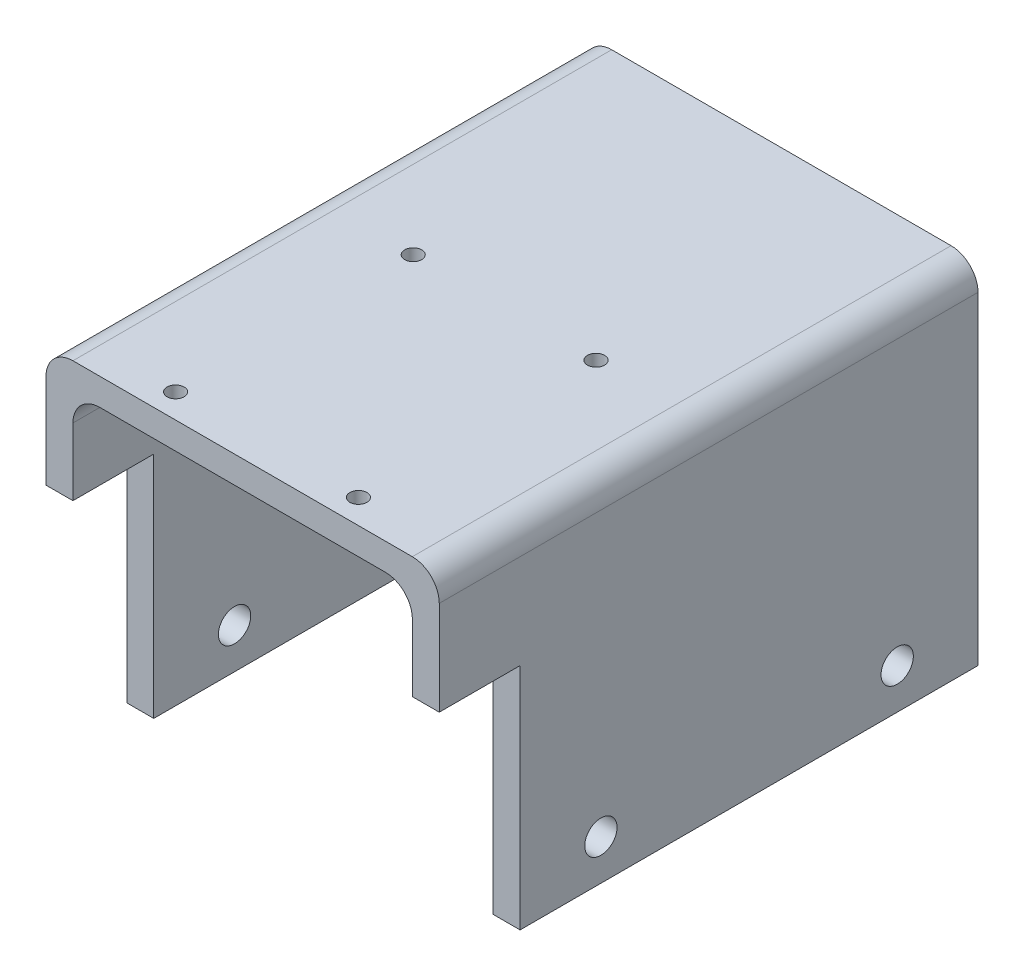
ISO-10303-21;
HEADER;
FILE_DESCRIPTION(('STEP AP214'),'2;1');
FILE_NAME('part.step','',(''),(''),'','','');
FILE_SCHEMA(('AUTOMOTIVE_DESIGN { 1 0 10303 214 1 1 1 1 }'));
ENDSEC;
DATA;
#1=APPLICATION_CONTEXT('core data for automotive mechanical design processes');
#2=APPLICATION_PROTOCOL_DEFINITION('international standard','automotive_design',2000,#1);
#3=PRODUCT_CONTEXT('',#1,'mechanical');
#4=PRODUCT('Part','Part','',(#3));
#5=PRODUCT_RELATED_PRODUCT_CATEGORY('part','',(#4));
#6=PRODUCT_DEFINITION_FORMATION('','',#4);
#7=PRODUCT_DEFINITION_CONTEXT('part definition',#1,'design');
#8=PRODUCT_DEFINITION('design','',#6,#7);
#9=PRODUCT_DEFINITION_SHAPE('','',#8);
#10=(LENGTH_UNIT() NAMED_UNIT(*) SI_UNIT(.MILLI.,.METRE.));
#11=(NAMED_UNIT(*) PLANE_ANGLE_UNIT() SI_UNIT($,.RADIAN.));
#12=(NAMED_UNIT(*) SI_UNIT($,.STERADIAN.) SOLID_ANGLE_UNIT());
#13=UNCERTAINTY_MEASURE_WITH_UNIT(LENGTH_MEASURE(1.E-05),#10,'distance_accuracy_value','');
#14=(GEOMETRIC_REPRESENTATION_CONTEXT(3) GLOBAL_UNCERTAINTY_ASSIGNED_CONTEXT((#13)) GLOBAL_UNIT_ASSIGNED_CONTEXT((#10,
#11,#12)) REPRESENTATION_CONTEXT('',''));
#15=CARTESIAN_POINT('',(0.,0.,0.));
#16=DIRECTION('',(0.,0.,1.));
#17=DIRECTION('',(1.,0.,0.));
#18=AXIS2_PLACEMENT_3D('',#15,#16,#17);
#19=CARTESIAN_POINT('',(-136.,130.,200.));
#20=DIRECTION('',(1.,0.,0.));
#21=DIRECTION('',(0.,1.,0.));
#22=AXIS2_PLACEMENT_3D('',#19,#20,#21);
#23=PLANE('',#22);
#24=CARTESIAN_POINT('',(-136.,15.,140.));
#25=DIRECTION('',(1.,0.,0.));
#26=DIRECTION('',(0.,0.,-1.));
#27=AXIS2_PLACEMENT_3D('',#24,#25,#26);
#28=CIRCLE('',#27,6.00000000000002);
#29=CARTESIAN_POINT('',(-136.,15.,134.));
#30=VERTEX_POINT('',#29);
#31=EDGE_CURVE('E491',#30,#30,#28,.T.);
#32=ORIENTED_EDGE('',*,*,#31,.T.);
#33=EDGE_LOOP('',(#32));
#34=FACE_BOUND('',#33,.T.);
#35=CARTESIAN_POINT('',(-136.,15.,30.));
#36=DIRECTION('',(1.,0.,0.));
#37=DIRECTION('',(0.,0.,-1.));
#38=AXIS2_PLACEMENT_3D('',#35,#36,#37);
#39=CIRCLE('',#38,6.);
#40=CARTESIAN_POINT('',(-136.,15.,24.));
#41=VERTEX_POINT('',#40);
#42=EDGE_CURVE('E490',#41,#41,#39,.T.);
#43=ORIENTED_EDGE('',*,*,#42,.T.);
#44=EDGE_LOOP('',(#43));
#45=FACE_BOUND('',#44,.T.);
#46=DIRECTION('',(0.,1.,0.));
#47=VECTOR('',#46,1.);
#48=CARTESIAN_POINT('',(-136.,85.,170.));
#49=LINE('',#48,#47);
#50=CARTESIAN_POINT('',(-136.,0.,170.));
#51=VERTEX_POINT('',#50);
#52=CARTESIAN_POINT('',(-136.,85.,170.));
#53=VERTEX_POINT('',#52);
#54=EDGE_CURVE('E157',#51,#53,#49,.T.);
#55=ORIENTED_EDGE('',*,*,#54,.T.);
#56=DIRECTION('',(0.,0.,1.));
#57=VECTOR('',#56,1.);
#58=CARTESIAN_POINT('',(-136.,85.,200.));
#59=LINE('',#58,#57);
#60=CARTESIAN_POINT('',(-136.,85.,200.));
#61=VERTEX_POINT('',#60);
#62=EDGE_CURVE('E168',#53,#61,#59,.T.);
#63=ORIENTED_EDGE('',*,*,#62,.T.);
#64=DIRECTION('',(0.,-1.,0.));
#65=VECTOR('',#64,1.);
#66=CARTESIAN_POINT('',(-136.,130.,200.));
#67=LINE('',#66,#65);
#68=CARTESIAN_POINT('',(-136.,120.,200.));
#69=VERTEX_POINT('',#68);
#70=EDGE_CURVE('E297',#69,#61,#67,.T.);
#71=ORIENTED_EDGE('',*,*,#70,.F.);
#72=DIRECTION('',(0.,0.,-1.));
#73=VECTOR('',#72,1.);
#74=CARTESIAN_POINT('',(-136.,120.,200.));
#75=LINE('',#74,#73);
#76=CARTESIAN_POINT('',(-136.,120.,0.));
#77=VERTEX_POINT('',#76);
#78=EDGE_CURVE('E230',#69,#77,#75,.T.);
#79=ORIENTED_EDGE('',*,*,#78,.T.);
#80=DIRECTION('',(0.,-1.,0.));
#81=VECTOR('',#80,1.);
#82=CARTESIAN_POINT('',(-136.,130.,0.));
#83=LINE('',#82,#81);
#84=CARTESIAN_POINT('',(-136.,0.,0.));
#85=VERTEX_POINT('',#84);
#86=EDGE_CURVE('E183',#77,#85,#83,.T.);
#87=ORIENTED_EDGE('',*,*,#86,.T.);
#88=DIRECTION('',(0.,0.,-1.));
#89=VECTOR('',#88,1.);
#90=CARTESIAN_POINT('',(-136.,0.,200.));
#91=LINE('',#90,#89);
#92=EDGE_CURVE('E174',#51,#85,#91,.T.);
#93=ORIENTED_EDGE('',*,*,#92,.F.);
#94=EDGE_LOOP('',(#55,#63,#71,#79,#87,#93));
#95=FACE_BOUND('',#94,.T.);
#96=ADVANCED_FACE('F44',(#34,#45,#95),#23,.F.);
#97=CARTESIAN_POINT('',(-136.,0.,200.));
#98=DIRECTION('',(0.,1.,0.));
#99=DIRECTION('',(0.,0.,1.));
#100=AXIS2_PLACEMENT_3D('',#97,#98,#99);
#101=PLANE('',#100);
#102=DIRECTION('',(0.,0.,-1.));
#103=VECTOR('',#102,1.);
#104=CARTESIAN_POINT('',(-126.,0.,200.));
#105=LINE('',#104,#103);
#106=CARTESIAN_POINT('',(-126.,0.,170.));
#107=VERTEX_POINT('',#106);
#108=CARTESIAN_POINT('',(-126.,0.,0.));
#109=VERTEX_POINT('',#108);
#110=EDGE_CURVE('E176',#107,#109,#105,.T.);
#111=ORIENTED_EDGE('',*,*,#110,.F.);
#112=DIRECTION('',(1.,0.,0.));
#113=VECTOR('',#112,1.);
#114=CARTESIAN_POINT('',(-136.,0.,170.));
#115=LINE('',#114,#113);
#116=EDGE_CURVE('E160',#51,#107,#115,.T.);
#117=ORIENTED_EDGE('',*,*,#116,.F.);
#118=ORIENTED_EDGE('',*,*,#92,.T.);
#119=DIRECTION('',(1.,0.,0.));
#120=VECTOR('',#119,1.);
#121=CARTESIAN_POINT('',(-136.,0.,0.));
#122=LINE('',#121,#120);
#123=EDGE_CURVE('E273',#85,#109,#122,.T.);
#124=ORIENTED_EDGE('',*,*,#123,.T.);
#125=EDGE_LOOP('',(#111,#117,#118,#124));
#126=FACE_BOUND('',#125,.T.);
#127=ADVANCED_FACE('F172',(#126),#101,.F.);
#128=CARTESIAN_POINT('',(-126.,0.,200.));
#129=DIRECTION('',(-1.,0.,0.));
#130=DIRECTION('',(0.,-1.,0.));
#131=AXIS2_PLACEMENT_3D('',#128,#129,#130);
#132=PLANE('',#131);
#133=CARTESIAN_POINT('',(-126.,15.,140.));
#134=DIRECTION('',(-1.,0.,0.));
#135=DIRECTION('',(0.,-1.,0.));
#136=AXIS2_PLACEMENT_3D('',#133,#134,#135);
#137=CIRCLE('',#136,6.00000000000002);
#138=CARTESIAN_POINT('',(-126.,8.99999999999998,140.));
#139=VERTEX_POINT('',#138);
#140=EDGE_CURVE('E337',#139,#139,#137,.T.);
#141=ORIENTED_EDGE('',*,*,#140,.T.);
#142=EDGE_LOOP('',(#141));
#143=FACE_BOUND('',#142,.T.);
#144=CARTESIAN_POINT('',(-126.,15.,30.));
#145=DIRECTION('',(-1.,0.,0.));
#146=DIRECTION('',(0.,-1.,0.));
#147=AXIS2_PLACEMENT_3D('',#144,#145,#146);
#148=CIRCLE('',#147,6.);
#149=CARTESIAN_POINT('',(-126.,9.,30.));
#150=VERTEX_POINT('',#149);
#151=EDGE_CURVE('E346',#150,#150,#148,.T.);
#152=ORIENTED_EDGE('',*,*,#151,.T.);
#153=EDGE_LOOP('',(#152));
#154=FACE_BOUND('',#153,.T.);
#155=DIRECTION('',(0.,1.,0.));
#156=VECTOR('',#155,1.);
#157=CARTESIAN_POINT('',(-126.,0.,200.));
#158=LINE('',#157,#156);
#159=CARTESIAN_POINT('',(-126.,85.,200.));
#160=VERTEX_POINT('',#159);
#161=CARTESIAN_POINT('',(-126.,110.,200.));
#162=VERTEX_POINT('',#161);
#163=EDGE_CURVE('E250',#160,#162,#158,.T.);
#164=ORIENTED_EDGE('',*,*,#163,.F.);
#165=DIRECTION('',(0.,0.,-1.));
#166=VECTOR('',#165,1.);
#167=CARTESIAN_POINT('',(-126.,85.,200.));
#168=LINE('',#167,#166);
#169=CARTESIAN_POINT('',(-126.,85.,170.));
#170=VERTEX_POINT('',#169);
#171=EDGE_CURVE('E60',#160,#170,#168,.T.);
#172=ORIENTED_EDGE('',*,*,#171,.T.);
#173=DIRECTION('',(0.,-1.,0.));
#174=VECTOR('',#173,1.);
#175=CARTESIAN_POINT('',(-126.,0.,170.));
#176=LINE('',#175,#174);
#177=EDGE_CURVE('E487',#170,#107,#176,.T.);
#178=ORIENTED_EDGE('',*,*,#177,.T.);
#179=ORIENTED_EDGE('',*,*,#110,.T.);
#180=DIRECTION('',(0.,1.,0.));
#181=VECTOR('',#180,1.);
#182=CARTESIAN_POINT('',(-126.,0.,0.));
#183=LINE('',#182,#181);
#184=CARTESIAN_POINT('',(-126.,110.,0.));
#185=VERTEX_POINT('',#184);
#186=EDGE_CURVE('E268',#109,#185,#183,.T.);
#187=ORIENTED_EDGE('',*,*,#186,.T.);
#188=DIRECTION('',(0.,0.,-1.));
#189=VECTOR('',#188,1.);
#190=CARTESIAN_POINT('',(-126.,110.,200.));
#191=LINE('',#190,#189);
#192=EDGE_CURVE('E203',#185,#162,#191,.F.);
#193=ORIENTED_EDGE('',*,*,#192,.T.);
#194=EDGE_LOOP('',(#164,#172,#178,#179,#187,#193));
#195=FACE_BOUND('',#194,.T.);
#196=ADVANCED_FACE('F271',(#143,#154,#195),#132,.F.);
#197=CARTESIAN_POINT('',(-126.,120.,200.));
#198=DIRECTION('',(0.,1.,0.));
#199=DIRECTION('',(0.,0.,1.));
#200=AXIS2_PLACEMENT_3D('',#197,#198,#199);
#201=PLANE('',#200);
#202=CARTESIAN_POINT('',(-29.072,120.,190.953));
#203=DIRECTION('',(0.,1.,0.));
#204=DIRECTION('',(0.,0.,1.));
#205=AXIS2_PLACEMENT_3D('',#202,#203,#204);
#206=CIRCLE('',#205,3.1665);
#207=CARTESIAN_POINT('',(-29.072,120.,194.1195));
#208=VERTEX_POINT('',#207);
#209=EDGE_CURVE('E444',#208,#208,#206,.F.);
#210=ORIENTED_EDGE('',*,*,#209,.F.);
#211=EDGE_LOOP('',(#210));
#212=FACE_BOUND('',#211,.T.);
#213=CARTESIAN_POINT('',(-96.928,120.,102.741));
#214=DIRECTION('',(0.,1.,0.));
#215=DIRECTION('',(0.,0.,1.));
#216=AXIS2_PLACEMENT_3D('',#213,#214,#215);
#217=CIRCLE('',#216,3.16650000000001);
#218=CARTESIAN_POINT('',(-96.928,120.,105.9075));
#219=VERTEX_POINT('',#218);
#220=EDGE_CURVE('E441',#219,#219,#217,.F.);
#221=ORIENTED_EDGE('',*,*,#220,.F.);
#222=EDGE_LOOP('',(#221));
#223=FACE_BOUND('',#222,.T.);
#224=CARTESIAN_POINT('',(-29.072,120.,102.741));
#225=DIRECTION('',(0.,1.,0.));
#226=DIRECTION('',(0.,0.,1.));
#227=AXIS2_PLACEMENT_3D('',#224,#225,#226);
#228=CIRCLE('',#227,3.1665);
#229=CARTESIAN_POINT('',(-29.072,120.,105.9075));
#230=VERTEX_POINT('',#229);
#231=EDGE_CURVE('E436',#230,#230,#228,.F.);
#232=ORIENTED_EDGE('',*,*,#231,.F.);
#233=EDGE_LOOP('',(#232));
#234=FACE_BOUND('',#233,.T.);
#235=CARTESIAN_POINT('',(-96.928,120.,190.953));
#236=DIRECTION('',(0.,1.,0.));
#237=DIRECTION('',(0.,0.,1.));
#238=AXIS2_PLACEMENT_3D('',#235,#236,#237);
#239=CIRCLE('',#238,3.16650000000001);
#240=CARTESIAN_POINT('',(-96.928,120.,194.1195));
#241=VERTEX_POINT('',#240);
#242=EDGE_CURVE('E463',#241,#241,#239,.F.);
#243=ORIENTED_EDGE('',*,*,#242,.F.);
#244=EDGE_LOOP('',(#243));
#245=FACE_BOUND('',#244,.T.);
#246=DIRECTION('',(1.,0.,0.));
#247=VECTOR('',#246,1.);
#248=CARTESIAN_POINT('',(-126.,120.,0.));
#249=LINE('',#248,#247);
#250=CARTESIAN_POINT('',(-116.,120.,0.));
#251=VERTEX_POINT('',#250);
#252=CARTESIAN_POINT('',(-9.99999999999999,120.,0.));
#253=VERTEX_POINT('',#252);
#254=EDGE_CURVE('E269',#251,#253,#249,.T.);
#255=ORIENTED_EDGE('',*,*,#254,.T.);
#256=DIRECTION('',(0.,0.,-1.));
#257=VECTOR('',#256,1.);
#258=CARTESIAN_POINT('',(-10.,120.,200.));
#259=LINE('',#258,#257);
#260=CARTESIAN_POINT('',(-9.99999999999999,120.,200.));
#261=VERTEX_POINT('',#260);
#262=EDGE_CURVE('E200',#253,#261,#259,.F.);
#263=ORIENTED_EDGE('',*,*,#262,.T.);
#264=DIRECTION('',(1.,0.,0.));
#265=VECTOR('',#264,1.);
#266=CARTESIAN_POINT('',(-126.,120.,200.));
#267=LINE('',#266,#265);
#268=CARTESIAN_POINT('',(-116.,120.,200.));
#269=VERTEX_POINT('',#268);
#270=EDGE_CURVE('E247',#269,#261,#267,.T.);
#271=ORIENTED_EDGE('',*,*,#270,.F.);
#272=DIRECTION('',(0.,0.,-1.));
#273=VECTOR('',#272,1.);
#274=CARTESIAN_POINT('',(-116.,120.,0.));
#275=LINE('',#274,#273);
#276=EDGE_CURVE('E191',#269,#251,#275,.T.);
#277=ORIENTED_EDGE('',*,*,#276,.T.);
#278=EDGE_LOOP('',(#255,#263,#271,#277));
#279=FACE_BOUND('',#278,.T.);
#280=ADVANCED_FACE('F256',(#212,#223,#234,#245,#279),#201,.F.);
#281=CARTESIAN_POINT('',(0.,120.,200.));
#282=DIRECTION('',(1.,0.,0.));
#283=DIRECTION('',(0.,0.,-1.));
#284=AXIS2_PLACEMENT_3D('',#281,#282,#283);
#285=PLANE('',#284);
#286=CARTESIAN_POINT('',(0.,15.,140.));
#287=DIRECTION('',(1.,0.,0.));
#288=DIRECTION('',(0.,0.,-1.));
#289=AXIS2_PLACEMENT_3D('',#286,#287,#288);
#290=CIRCLE('',#289,6.00000000000002);
#291=CARTESIAN_POINT('',(0.,15.,134.));
#292=VERTEX_POINT('',#291);
#293=EDGE_CURVE('E340',#292,#292,#290,.T.);
#294=ORIENTED_EDGE('',*,*,#293,.T.);
#295=EDGE_LOOP('',(#294));
#296=FACE_BOUND('',#295,.T.);
#297=CARTESIAN_POINT('',(0.,15.,30.));
#298=DIRECTION('',(1.,0.,0.));
#299=DIRECTION('',(0.,0.,-1.));
#300=AXIS2_PLACEMENT_3D('',#297,#298,#299);
#301=CIRCLE('',#300,6.);
#302=CARTESIAN_POINT('',(0.,15.,24.));
#303=VERTEX_POINT('',#302);
#304=EDGE_CURVE('E494',#303,#303,#301,.T.);
#305=ORIENTED_EDGE('',*,*,#304,.T.);
#306=EDGE_LOOP('',(#305));
#307=FACE_BOUND('',#306,.T.);
#308=DIRECTION('',(0.,1.,0.));
#309=VECTOR('',#308,1.);
#310=CARTESIAN_POINT('',(0.,120.,170.));
#311=LINE('',#310,#309);
#312=CARTESIAN_POINT('',(0.,0.,170.));
#313=VERTEX_POINT('',#312);
#314=CARTESIAN_POINT('',(0.,85.,170.));
#315=VERTEX_POINT('',#314);
#316=EDGE_CURVE('E484',#313,#315,#311,.T.);
#317=ORIENTED_EDGE('',*,*,#316,.T.);
#318=DIRECTION('',(0.,0.,1.));
#319=VECTOR('',#318,1.);
#320=CARTESIAN_POINT('',(0.,85.,200.));
#321=LINE('',#320,#319);
#322=CARTESIAN_POINT('',(0.,85.,200.));
#323=VERTEX_POINT('',#322);
#324=EDGE_CURVE('E357',#315,#323,#321,.T.);
#325=ORIENTED_EDGE('',*,*,#324,.T.);
#326=DIRECTION('',(0.,-1.,0.));
#327=VECTOR('',#326,1.);
#328=CARTESIAN_POINT('',(0.,120.,200.));
#329=LINE('',#328,#327);
#330=CARTESIAN_POINT('',(0.,110.,200.));
#331=VERTEX_POINT('',#330);
#332=EDGE_CURVE('E260',#331,#323,#329,.T.);
#333=ORIENTED_EDGE('',*,*,#332,.F.);
#334=DIRECTION('',(0.,0.,-1.));
#335=VECTOR('',#334,1.);
#336=CARTESIAN_POINT('',(0.,110.,0.));
#337=LINE('',#336,#335);
#338=CARTESIAN_POINT('',(0.,110.,0.));
#339=VERTEX_POINT('',#338);
#340=EDGE_CURVE('E186',#331,#339,#337,.T.);
#341=ORIENTED_EDGE('',*,*,#340,.T.);
#342=DIRECTION('',(0.,-1.,0.));
#343=VECTOR('',#342,1.);
#344=CARTESIAN_POINT('',(0.,120.,0.));
#345=LINE('',#344,#343);
#346=CARTESIAN_POINT('',(0.,0.,0.));
#347=VERTEX_POINT('',#346);
#348=EDGE_CURVE('E277',#339,#347,#345,.T.);
#349=ORIENTED_EDGE('',*,*,#348,.T.);
#350=DIRECTION('',(0.,0.,-1.));
#351=VECTOR('',#350,1.);
#352=CARTESIAN_POINT('',(0.,0.,200.));
#353=LINE('',#352,#351);
#354=EDGE_CURVE('E193',#313,#347,#353,.T.);
#355=ORIENTED_EDGE('',*,*,#354,.F.);
#356=EDGE_LOOP('',(#317,#325,#333,#341,#349,#355));
#357=FACE_BOUND('',#356,.T.);
#358=ADVANCED_FACE('F312',(#296,#307,#357),#285,.F.);
#359=CARTESIAN_POINT('',(0.,0.,200.));
#360=DIRECTION('',(0.,1.,0.));
#361=DIRECTION('',(0.,0.,1.));
#362=AXIS2_PLACEMENT_3D('',#359,#360,#361);
#363=PLANE('',#362);
#364=DIRECTION('',(0.,0.,-1.));
#365=VECTOR('',#364,1.);
#366=CARTESIAN_POINT('',(10.,0.,200.));
#367=LINE('',#366,#365);
#368=CARTESIAN_POINT('',(10.,0.,170.));
#369=VERTEX_POINT('',#368);
#370=CARTESIAN_POINT('',(10.,0.,0.));
#371=VERTEX_POINT('',#370);
#372=EDGE_CURVE('E298',#369,#371,#367,.T.);
#373=ORIENTED_EDGE('',*,*,#372,.F.);
#374=EDGE_CURVE('E179',#313,#369,#115,.T.);
#375=ORIENTED_EDGE('',*,*,#374,.F.);
#376=ORIENTED_EDGE('',*,*,#354,.T.);
#377=DIRECTION('',(1.,0.,0.));
#378=VECTOR('',#377,1.);
#379=CARTESIAN_POINT('',(0.,0.,0.));
#380=LINE('',#379,#378);
#381=EDGE_CURVE('E285',#347,#371,#380,.T.);
#382=ORIENTED_EDGE('',*,*,#381,.T.);
#383=EDGE_LOOP('',(#373,#375,#376,#382));
#384=FACE_BOUND('',#383,.T.);
#385=ADVANCED_FACE('F306',(#384),#363,.F.);
#386=CARTESIAN_POINT('',(10.,0.,200.));
#387=DIRECTION('',(-1.,0.,0.));
#388=DIRECTION('',(0.,0.,1.));
#389=AXIS2_PLACEMENT_3D('',#386,#387,#388);
#390=PLANE('',#389);
#391=CARTESIAN_POINT('',(10.,15.,140.));
#392=DIRECTION('',(1.,0.,0.));
#393=DIRECTION('',(0.,0.,-1.));
#394=AXIS2_PLACEMENT_3D('',#391,#392,#393);
#395=CIRCLE('',#394,6.00000000000002);
#396=CARTESIAN_POINT('',(10.,15.,134.));
#397=VERTEX_POINT('',#396);
#398=EDGE_CURVE('E495',#397,#397,#395,.T.);
#399=ORIENTED_EDGE('',*,*,#398,.F.);
#400=EDGE_LOOP('',(#399));
#401=FACE_BOUND('',#400,.T.);
#402=CARTESIAN_POINT('',(10.,15.,30.));
#403=DIRECTION('',(1.,0.,0.));
#404=DIRECTION('',(0.,0.,-1.));
#405=AXIS2_PLACEMENT_3D('',#402,#403,#404);
#406=CIRCLE('',#405,6.);
#407=CARTESIAN_POINT('',(10.,15.,24.));
#408=VERTEX_POINT('',#407);
#409=EDGE_CURVE('E499',#408,#408,#406,.T.);
#410=ORIENTED_EDGE('',*,*,#409,.F.);
#411=EDGE_LOOP('',(#410));
#412=FACE_BOUND('',#411,.T.);
#413=DIRECTION('',(0.,1.,0.));
#414=VECTOR('',#413,1.);
#415=CARTESIAN_POINT('',(10.,0.,200.));
#416=LINE('',#415,#414);
#417=CARTESIAN_POINT('',(10.,85.,200.));
#418=VERTEX_POINT('',#417);
#419=CARTESIAN_POINT('',(10.,120.,200.));
#420=VERTEX_POINT('',#419);
#421=EDGE_CURVE('E327',#418,#420,#416,.T.);
#422=ORIENTED_EDGE('',*,*,#421,.F.);
#423=DIRECTION('',(0.,0.,1.));
#424=VECTOR('',#423,1.);
#425=CARTESIAN_POINT('',(10.,85.,200.));
#426=LINE('',#425,#424);
#427=CARTESIAN_POINT('',(10.,85.,170.));
#428=VERTEX_POINT('',#427);
#429=EDGE_CURVE('E67',#428,#418,#426,.T.);
#430=ORIENTED_EDGE('',*,*,#429,.F.);
#431=DIRECTION('',(0.,1.,0.));
#432=VECTOR('',#431,1.);
#433=CARTESIAN_POINT('',(10.,85.,170.));
#434=LINE('',#433,#432);
#435=EDGE_CURVE('E466',#369,#428,#434,.T.);
#436=ORIENTED_EDGE('',*,*,#435,.F.);
#437=ORIENTED_EDGE('',*,*,#372,.T.);
#438=DIRECTION('',(0.,1.,0.));
#439=VECTOR('',#438,1.);
#440=CARTESIAN_POINT('',(10.,0.,0.));
#441=LINE('',#440,#439);
#442=CARTESIAN_POINT('',(10.,120.,0.));
#443=VERTEX_POINT('',#442);
#444=EDGE_CURVE('E289',#371,#443,#441,.T.);
#445=ORIENTED_EDGE('',*,*,#444,.T.);
#446=DIRECTION('',(0.,0.,-1.));
#447=VECTOR('',#446,1.);
#448=CARTESIAN_POINT('',(10.,120.,200.));
#449=LINE('',#448,#447);
#450=EDGE_CURVE('E220',#443,#420,#449,.F.);
#451=ORIENTED_EDGE('',*,*,#450,.T.);
#452=EDGE_LOOP('',(#422,#430,#436,#437,#445,#451));
#453=FACE_BOUND('',#452,.T.);
#454=ADVANCED_FACE('F318',(#401,#412,#453),#390,.F.);
#455=CARTESIAN_POINT('',(10.,130.,200.));
#456=DIRECTION('',(0.,-1.,0.));
#457=DIRECTION('',(1.,0.,0.));
#458=AXIS2_PLACEMENT_3D('',#455,#456,#457);
#459=PLANE('',#458);
#460=CARTESIAN_POINT('',(-29.072,130.,190.953));
#461=DIRECTION('',(0.,1.,0.));
#462=DIRECTION('',(-1.,0.,0.));
#463=AXIS2_PLACEMENT_3D('',#460,#461,#462);
#464=CIRCLE('',#463,3.1665);
#465=CARTESIAN_POINT('',(-32.2385,130.,190.953));
#466=VERTEX_POINT('',#465);
#467=EDGE_CURVE('E448',#466,#466,#464,.T.);
#468=ORIENTED_EDGE('',*,*,#467,.F.);
#469=EDGE_LOOP('',(#468));
#470=FACE_BOUND('',#469,.T.);
#471=CARTESIAN_POINT('',(-96.928,130.,102.741));
#472=DIRECTION('',(0.,1.,0.));
#473=DIRECTION('',(-1.,0.,0.));
#474=AXIS2_PLACEMENT_3D('',#471,#472,#473);
#475=CIRCLE('',#474,3.16650000000001);
#476=CARTESIAN_POINT('',(-100.0945,130.,102.741));
#477=VERTEX_POINT('',#476);
#478=EDGE_CURVE('E449',#477,#477,#475,.T.);
#479=ORIENTED_EDGE('',*,*,#478,.F.);
#480=EDGE_LOOP('',(#479));
#481=FACE_BOUND('',#480,.T.);
#482=CARTESIAN_POINT('',(-29.072,130.,102.741));
#483=DIRECTION('',(0.,1.,0.));
#484=DIRECTION('',(-1.,0.,0.));
#485=AXIS2_PLACEMENT_3D('',#482,#483,#484);
#486=CIRCLE('',#485,3.1665);
#487=CARTESIAN_POINT('',(-32.2385,130.,102.741));
#488=VERTEX_POINT('',#487);
#489=EDGE_CURVE('E433',#488,#488,#486,.T.);
#490=ORIENTED_EDGE('',*,*,#489,.F.);
#491=EDGE_LOOP('',(#490));
#492=FACE_BOUND('',#491,.T.);
#493=CARTESIAN_POINT('',(-96.928,130.,190.953));
#494=DIRECTION('',(0.,1.,0.));
#495=DIRECTION('',(-1.,0.,0.));
#496=AXIS2_PLACEMENT_3D('',#493,#494,#495);
#497=CIRCLE('',#496,3.16650000000001);
#498=CARTESIAN_POINT('',(-100.0945,130.,190.953));
#499=VERTEX_POINT('',#498);
#500=EDGE_CURVE('E453',#499,#499,#497,.T.);
#501=ORIENTED_EDGE('',*,*,#500,.F.);
#502=EDGE_LOOP('',(#501));
#503=FACE_BOUND('',#502,.T.);
#504=DIRECTION('',(-1.,0.,0.));
#505=VECTOR('',#504,1.);
#506=CARTESIAN_POINT('',(10.,130.,200.));
#507=LINE('',#506,#505);
#508=CARTESIAN_POINT('',(0.,130.,200.));
#509=VERTEX_POINT('',#508);
#510=CARTESIAN_POINT('',(-126.,130.,200.));
#511=VERTEX_POINT('',#510);
#512=EDGE_CURVE('E300',#509,#511,#507,.T.);
#513=ORIENTED_EDGE('',*,*,#512,.F.);
#514=DIRECTION('',(0.,0.,-1.));
#515=VECTOR('',#514,1.);
#516=CARTESIAN_POINT('',(0.,130.,200.));
#517=LINE('',#516,#515);
#518=CARTESIAN_POINT('',(0.,130.,0.));
#519=VERTEX_POINT('',#518);
#520=EDGE_CURVE('E210',#509,#519,#517,.T.);
#521=ORIENTED_EDGE('',*,*,#520,.T.);
#522=DIRECTION('',(-1.,0.,0.));
#523=VECTOR('',#522,1.);
#524=CARTESIAN_POINT('',(10.,130.,0.));
#525=LINE('',#524,#523);
#526=CARTESIAN_POINT('',(-126.,130.,0.));
#527=VERTEX_POINT('',#526);
#528=EDGE_CURVE('E293',#519,#527,#525,.T.);
#529=ORIENTED_EDGE('',*,*,#528,.T.);
#530=DIRECTION('',(0.,0.,-1.));
#531=VECTOR('',#530,1.);
#532=CARTESIAN_POINT('',(-126.,130.,200.));
#533=LINE('',#532,#531);
#534=EDGE_CURVE('E207',#527,#511,#533,.F.);
#535=ORIENTED_EDGE('',*,*,#534,.T.);
#536=EDGE_LOOP('',(#513,#521,#529,#535));
#537=FACE_BOUND('',#536,.T.);
#538=ADVANCED_FACE('F329',(#470,#481,#492,#503,#537),#459,.F.);
#539=CARTESIAN_POINT('',(0.,0.,200.));
#540=DIRECTION('',(0.,0.,1.));
#541=DIRECTION('',(1.,0.,0.));
#542=AXIS2_PLACEMENT_3D('',#539,#540,#541);
#543=PLANE('',#542);
#544=DIRECTION('',(-1.,0.,0.));
#545=VECTOR('',#544,1.);
#546=CARTESIAN_POINT('',(0.,85.,200.));
#547=LINE('',#546,#545);
#548=EDGE_CURVE('E11',#418,#323,#547,.T.);
#549=ORIENTED_EDGE('',*,*,#548,.F.);
#550=ORIENTED_EDGE('',*,*,#421,.T.);
#551=CARTESIAN_POINT('',(0.,120.,200.));
#552=DIRECTION('',(0.,0.,1.));
#553=DIRECTION('',(1.,0.,0.));
#554=AXIS2_PLACEMENT_3D('',#551,#552,#553);
#555=CIRCLE('',#554,10.);
#556=EDGE_CURVE('E227',#420,#509,#555,.T.);
#557=ORIENTED_EDGE('',*,*,#556,.T.);
#558=ORIENTED_EDGE('',*,*,#512,.T.);
#559=CARTESIAN_POINT('',(-126.,120.,200.));
#560=DIRECTION('',(0.,0.,1.));
#561=DIRECTION('',(1.,0.,0.));
#562=AXIS2_PLACEMENT_3D('',#559,#560,#561);
#563=CIRCLE('',#562,10.);
#564=EDGE_CURVE('E224',#511,#69,#563,.T.);
#565=ORIENTED_EDGE('',*,*,#564,.T.);
#566=ORIENTED_EDGE('',*,*,#70,.T.);
#567=DIRECTION('',(1.,0.,0.));
#568=VECTOR('',#567,1.);
#569=CARTESIAN_POINT('',(-136.,85.,200.));
#570=LINE('',#569,#568);
#571=EDGE_CURVE('E475',#61,#160,#570,.T.);
#572=ORIENTED_EDGE('',*,*,#571,.T.);
#573=ORIENTED_EDGE('',*,*,#163,.T.);
#574=CARTESIAN_POINT('',(-116.,110.,200.));
#575=DIRECTION('',(0.,0.,1.));
#576=DIRECTION('',(1.,0.,0.));
#577=AXIS2_PLACEMENT_3D('',#574,#575,#576);
#578=CIRCLE('',#577,10.);
#579=EDGE_CURVE('E53',#162,#269,#578,.F.);
#580=ORIENTED_EDGE('',*,*,#579,.T.);
#581=ORIENTED_EDGE('',*,*,#270,.T.);
#582=CARTESIAN_POINT('',(-10.,110.,200.));
#583=DIRECTION('',(0.,0.,1.));
#584=DIRECTION('',(1.,0.,0.));
#585=AXIS2_PLACEMENT_3D('',#582,#583,#584);
#586=CIRCLE('',#585,10.);
#587=EDGE_CURVE('E236',#261,#331,#586,.F.);
#588=ORIENTED_EDGE('',*,*,#587,.T.);
#589=ORIENTED_EDGE('',*,*,#332,.T.);
#590=EDGE_LOOP('',(#549,#550,#557,#558,#565,#566,#572,#573,#580,#581,#588,#589));
#591=FACE_BOUND('',#590,.T.);
#592=ADVANCED_FACE('F246',(#591),#543,.T.);
#593=CARTESIAN_POINT('',(0.,0.,0.));
#594=DIRECTION('',(0.,0.,1.));
#595=DIRECTION('',(1.,0.,0.));
#596=AXIS2_PLACEMENT_3D('',#593,#594,#595);
#597=PLANE('',#596);
#598=ORIENTED_EDGE('',*,*,#528,.F.);
#599=CARTESIAN_POINT('',(0.,120.,0.));
#600=DIRECTION('',(0.,0.,1.));
#601=DIRECTION('',(1.,0.,0.));
#602=AXIS2_PLACEMENT_3D('',#599,#600,#601);
#603=CIRCLE('',#602,10.);
#604=EDGE_CURVE('E217',#519,#443,#603,.F.);
#605=ORIENTED_EDGE('',*,*,#604,.T.);
#606=ORIENTED_EDGE('',*,*,#444,.F.);
#607=ORIENTED_EDGE('',*,*,#381,.F.);
#608=ORIENTED_EDGE('',*,*,#348,.F.);
#609=CARTESIAN_POINT('',(-10.,110.,0.));
#610=DIRECTION('',(0.,0.,1.));
#611=DIRECTION('',(1.,0.,0.));
#612=AXIS2_PLACEMENT_3D('',#609,#610,#611);
#613=CIRCLE('',#612,10.);
#614=EDGE_CURVE('E233',#339,#253,#613,.T.);
#615=ORIENTED_EDGE('',*,*,#614,.T.);
#616=ORIENTED_EDGE('',*,*,#254,.F.);
#617=CARTESIAN_POINT('',(-116.,110.,0.));
#618=DIRECTION('',(0.,0.,1.));
#619=DIRECTION('',(1.,0.,0.));
#620=AXIS2_PLACEMENT_3D('',#617,#618,#619);
#621=CIRCLE('',#620,10.);
#622=EDGE_CURVE('E239',#251,#185,#621,.T.);
#623=ORIENTED_EDGE('',*,*,#622,.T.);
#624=ORIENTED_EDGE('',*,*,#186,.F.);
#625=ORIENTED_EDGE('',*,*,#123,.F.);
#626=ORIENTED_EDGE('',*,*,#86,.F.);
#627=CARTESIAN_POINT('',(-126.,120.,0.));
#628=DIRECTION('',(0.,0.,1.));
#629=DIRECTION('',(1.,0.,0.));
#630=AXIS2_PLACEMENT_3D('',#627,#628,#629);
#631=CIRCLE('',#630,10.);
#632=EDGE_CURVE('E214',#77,#527,#631,.F.);
#633=ORIENTED_EDGE('',*,*,#632,.T.);
#634=EDGE_LOOP('',(#598,#605,#606,#607,#608,#615,#616,#623,#624,#625,#626,#633));
#635=FACE_BOUND('',#634,.T.);
#636=ADVANCED_FACE('F267',(#635),#597,.F.);
#637=CARTESIAN_POINT('',(-10.,110.,200.));
#638=DIRECTION('',(0.,0.,1.));
#639=DIRECTION('',(1.,0.,0.));
#640=AXIS2_PLACEMENT_3D('',#637,#638,#639);
#641=CYLINDRICAL_SURFACE('',#640,10.);
#642=ORIENTED_EDGE('',*,*,#587,.F.);
#643=ORIENTED_EDGE('',*,*,#262,.F.);
#644=ORIENTED_EDGE('',*,*,#614,.F.);
#645=ORIENTED_EDGE('',*,*,#340,.F.);
#646=EDGE_LOOP('',(#642,#643,#644,#645));
#647=FACE_BOUND('',#646,.T.);
#648=ADVANCED_FACE('F359',(#647),#641,.F.);
#649=CARTESIAN_POINT('',(-116.,110.,200.));
#650=DIRECTION('',(0.,0.,1.));
#651=DIRECTION('',(1.,0.,0.));
#652=AXIS2_PLACEMENT_3D('',#649,#650,#651);
#653=CYLINDRICAL_SURFACE('',#652,10.);
#654=ORIENTED_EDGE('',*,*,#579,.F.);
#655=ORIENTED_EDGE('',*,*,#192,.F.);
#656=ORIENTED_EDGE('',*,*,#622,.F.);
#657=ORIENTED_EDGE('',*,*,#276,.F.);
#658=EDGE_LOOP('',(#654,#655,#656,#657));
#659=FACE_BOUND('',#658,.T.);
#660=ADVANCED_FACE('F262',(#659),#653,.F.);
#661=CARTESIAN_POINT('',(0.,120.,200.));
#662=DIRECTION('',(0.,0.,-1.));
#663=DIRECTION('',(-1.,0.,0.));
#664=AXIS2_PLACEMENT_3D('',#661,#662,#663);
#665=CYLINDRICAL_SURFACE('',#664,10.);
#666=ORIENTED_EDGE('',*,*,#556,.F.);
#667=ORIENTED_EDGE('',*,*,#450,.F.);
#668=ORIENTED_EDGE('',*,*,#604,.F.);
#669=ORIENTED_EDGE('',*,*,#520,.F.);
#670=EDGE_LOOP('',(#666,#667,#668,#669));
#671=FACE_BOUND('',#670,.T.);
#672=ADVANCED_FACE('F322',(#671),#665,.T.);
#673=CARTESIAN_POINT('',(-126.,120.,200.));
#674=DIRECTION('',(0.,0.,-1.));
#675=DIRECTION('',(-1.,0.,0.));
#676=AXIS2_PLACEMENT_3D('',#673,#674,#675);
#677=CYLINDRICAL_SURFACE('',#676,10.);
#678=ORIENTED_EDGE('',*,*,#564,.F.);
#679=ORIENTED_EDGE('',*,*,#534,.F.);
#680=ORIENTED_EDGE('',*,*,#632,.F.);
#681=ORIENTED_EDGE('',*,*,#78,.F.);
#682=EDGE_LOOP('',(#678,#679,#680,#681));
#683=FACE_BOUND('',#682,.T.);
#684=ADVANCED_FACE('F46',(#683),#677,.T.);
#685=CARTESIAN_POINT('',(-136.,15.,30.));
#686=DIRECTION('',(1.,0.,0.));
#687=DIRECTION('',(0.,0.,-1.));
#688=AXIS2_PLACEMENT_3D('',#685,#686,#687);
#689=CYLINDRICAL_SURFACE('',#688,6.);
#690=ORIENTED_EDGE('',*,*,#409,.T.);
#691=EDGE_LOOP('',(#690));
#692=FACE_BOUND('',#691,.T.);
#693=ORIENTED_EDGE('',*,*,#304,.F.);
#694=EDGE_LOOP('',(#693));
#695=FACE_BOUND('',#694,.T.);
#696=ADVANCED_FACE('F402',(#692,#695),#689,.F.);
#697=CARTESIAN_POINT('',(-136.,15.,140.));
#698=DIRECTION('',(1.,0.,0.));
#699=DIRECTION('',(0.,0.,-1.));
#700=AXIS2_PLACEMENT_3D('',#697,#698,#699);
#701=CYLINDRICAL_SURFACE('',#700,6.00000000000002);
#702=ORIENTED_EDGE('',*,*,#398,.T.);
#703=EDGE_LOOP('',(#702));
#704=FACE_BOUND('',#703,.T.);
#705=ORIENTED_EDGE('',*,*,#293,.F.);
#706=EDGE_LOOP('',(#705));
#707=FACE_BOUND('',#706,.T.);
#708=ADVANCED_FACE('F400',(#704,#707),#701,.F.);
#709=ORIENTED_EDGE('',*,*,#42,.F.);
#710=EDGE_LOOP('',(#709));
#711=FACE_BOUND('',#710,.T.);
#712=ORIENTED_EDGE('',*,*,#151,.F.);
#713=EDGE_LOOP('',(#712));
#714=FACE_BOUND('',#713,.T.);
#715=ADVANCED_FACE('F396',(#711,#714),#689,.F.);
#716=ORIENTED_EDGE('',*,*,#31,.F.);
#717=EDGE_LOOP('',(#716));
#718=FACE_BOUND('',#717,.T.);
#719=ORIENTED_EDGE('',*,*,#140,.F.);
#720=EDGE_LOOP('',(#719));
#721=FACE_BOUND('',#720,.T.);
#722=ADVANCED_FACE('F399',(#718,#721),#701,.F.);
#723=CARTESIAN_POINT('',(-136.,85.,200.));
#724=DIRECTION('',(0.,1.,0.));
#725=DIRECTION('',(0.,0.,1.));
#726=AXIS2_PLACEMENT_3D('',#723,#724,#725);
#727=PLANE('',#726);
#728=ORIENTED_EDGE('',*,*,#571,.F.);
#729=ORIENTED_EDGE('',*,*,#62,.F.);
#730=DIRECTION('',(1.,0.,0.));
#731=VECTOR('',#730,1.);
#732=CARTESIAN_POINT('',(-136.,85.,170.));
#733=LINE('',#732,#731);
#734=EDGE_CURVE('E162',#53,#170,#733,.T.);
#735=ORIENTED_EDGE('',*,*,#734,.T.);
#736=ORIENTED_EDGE('',*,*,#171,.F.);
#737=EDGE_LOOP('',(#728,#729,#735,#736));
#738=FACE_BOUND('',#737,.T.);
#739=ADVANCED_FACE('F405',(#738),#727,.F.);
#740=CARTESIAN_POINT('',(-136.,85.,170.));
#741=DIRECTION('',(0.,0.,-1.));
#742=DIRECTION('',(-1.,0.,0.));
#743=AXIS2_PLACEMENT_3D('',#740,#741,#742);
#744=PLANE('',#743);
#745=ORIENTED_EDGE('',*,*,#734,.F.);
#746=ORIENTED_EDGE('',*,*,#54,.F.);
#747=ORIENTED_EDGE('',*,*,#116,.T.);
#748=ORIENTED_EDGE('',*,*,#177,.F.);
#749=EDGE_LOOP('',(#745,#746,#747,#748));
#750=FACE_BOUND('',#749,.T.);
#751=ADVANCED_FACE('F159',(#750),#744,.F.);
#752=ORIENTED_EDGE('',*,*,#374,.T.);
#753=ORIENTED_EDGE('',*,*,#435,.T.);
#754=EDGE_CURVE('E178',#315,#428,#733,.T.);
#755=ORIENTED_EDGE('',*,*,#754,.F.);
#756=ORIENTED_EDGE('',*,*,#316,.F.);
#757=EDGE_LOOP('',(#752,#753,#755,#756));
#758=FACE_BOUND('',#757,.T.);
#759=ADVANCED_FACE('F409',(#758),#744,.F.);
#760=ORIENTED_EDGE('',*,*,#754,.T.);
#761=ORIENTED_EDGE('',*,*,#429,.T.);
#762=ORIENTED_EDGE('',*,*,#548,.T.);
#763=ORIENTED_EDGE('',*,*,#324,.F.);
#764=EDGE_LOOP('',(#760,#761,#762,#763));
#765=FACE_BOUND('',#764,.T.);
#766=ADVANCED_FACE('F412',(#765),#727,.F.);
#767=CARTESIAN_POINT('',(-96.928,-0.00100000000002876,190.953));
#768=DIRECTION('',(0.,1.,0.));
#769=DIRECTION('',(-1.,0.,0.));
#770=AXIS2_PLACEMENT_3D('',#767,#768,#769);
#771=CYLINDRICAL_SURFACE('',#770,3.16650000000001);
#772=ORIENTED_EDGE('',*,*,#500,.T.);
#773=EDGE_LOOP('',(#772));
#774=FACE_BOUND('',#773,.T.);
#775=ORIENTED_EDGE('',*,*,#242,.T.);
#776=EDGE_LOOP('',(#775));
#777=FACE_BOUND('',#776,.T.);
#778=ADVANCED_FACE('F413',(#774,#777),#771,.F.);
#779=CARTESIAN_POINT('',(-29.072,-0.001000000000001,102.741));
#780=DIRECTION('',(0.,1.,0.));
#781=DIRECTION('',(-1.,0.,0.));
#782=AXIS2_PLACEMENT_3D('',#779,#780,#781);
#783=CYLINDRICAL_SURFACE('',#782,3.1665);
#784=ORIENTED_EDGE('',*,*,#489,.T.);
#785=EDGE_LOOP('',(#784));
#786=FACE_BOUND('',#785,.T.);
#787=ORIENTED_EDGE('',*,*,#231,.T.);
#788=EDGE_LOOP('',(#787));
#789=FACE_BOUND('',#788,.T.);
#790=ADVANCED_FACE('F416',(#786,#789),#783,.F.);
#791=CARTESIAN_POINT('',(-96.928,-0.00100000000002876,102.741));
#792=DIRECTION('',(0.,1.,0.));
#793=DIRECTION('',(-1.,0.,0.));
#794=AXIS2_PLACEMENT_3D('',#791,#792,#793);
#795=CYLINDRICAL_SURFACE('',#794,3.16650000000001);
#796=ORIENTED_EDGE('',*,*,#478,.T.);
#797=EDGE_LOOP('',(#796));
#798=FACE_BOUND('',#797,.T.);
#799=ORIENTED_EDGE('',*,*,#220,.T.);
#800=EDGE_LOOP('',(#799));
#801=FACE_BOUND('',#800,.T.);
#802=ADVANCED_FACE('F418',(#798,#801),#795,.F.);
#803=CARTESIAN_POINT('',(-29.072,-0.001000000000001,190.953));
#804=DIRECTION('',(0.,1.,0.));
#805=DIRECTION('',(-1.,0.,0.));
#806=AXIS2_PLACEMENT_3D('',#803,#804,#805);
#807=CYLINDRICAL_SURFACE('',#806,3.1665);
#808=ORIENTED_EDGE('',*,*,#467,.T.);
#809=EDGE_LOOP('',(#808));
#810=FACE_BOUND('',#809,.T.);
#811=ORIENTED_EDGE('',*,*,#209,.T.);
#812=EDGE_LOOP('',(#811));
#813=FACE_BOUND('',#812,.T.);
#814=ADVANCED_FACE('F421',(#810,#813),#807,.F.);
#815=CLOSED_SHELL('',(#96,#127,#196,#280,#358,#385,#454,#538,#592,#636,#648,#660,#672,#684,#696,
#708,#715,#722,#739,#751,#759,#766,#778,#790,#802,#814));
#816=MANIFOLD_SOLID_BREP('B2',#815);
#817=ADVANCED_BREP_SHAPE_REPRESENTATION('',(#18,#816),#14);
#818=SHAPE_DEFINITION_REPRESENTATION(#9,#817);
ENDSEC;
END-ISO-10303-21;
